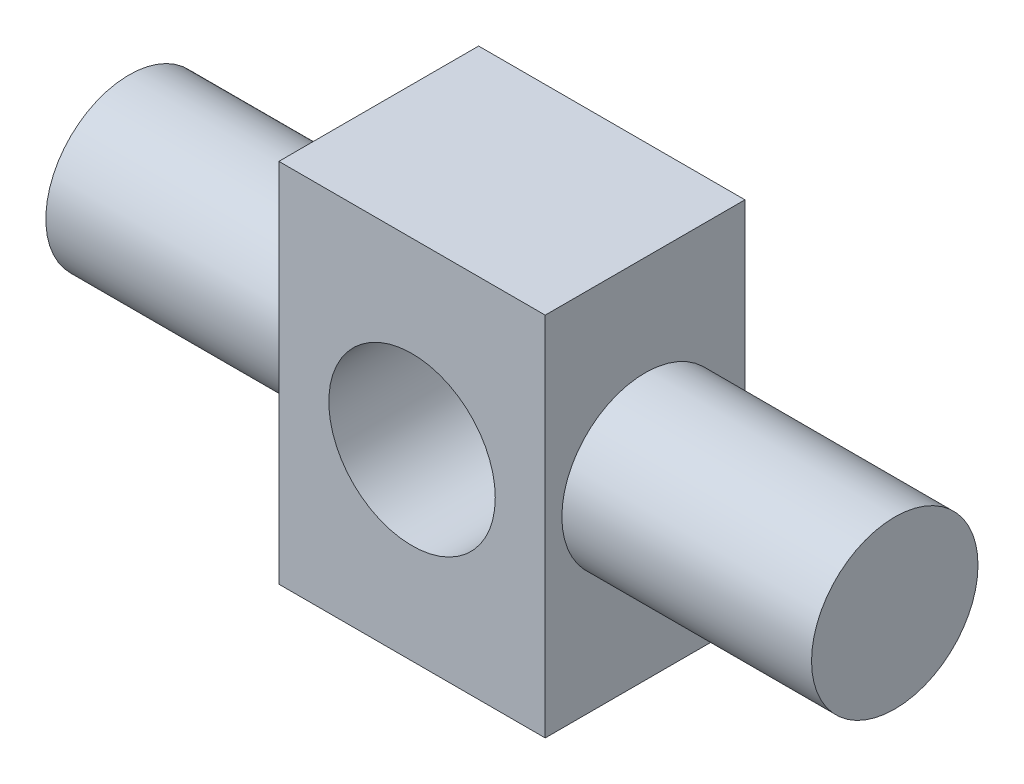
ISO-10303-21;
HEADER;
FILE_DESCRIPTION(('STEP AP214'),'2;1');
FILE_NAME('part.step','',(''),(''),'','','');
FILE_SCHEMA(('AUTOMOTIVE_DESIGN { 1 0 10303 214 1 1 1 1 }'));
ENDSEC;
DATA;
#1=APPLICATION_CONTEXT('core data for automotive mechanical design processes');
#2=APPLICATION_PROTOCOL_DEFINITION('international standard','automotive_design',2000,#1);
#3=PRODUCT_CONTEXT('',#1,'mechanical');
#4=PRODUCT('Part','Part','',(#3));
#5=PRODUCT_RELATED_PRODUCT_CATEGORY('part','',(#4));
#6=PRODUCT_DEFINITION_FORMATION('','',#4);
#7=PRODUCT_DEFINITION_CONTEXT('part definition',#1,'design');
#8=PRODUCT_DEFINITION('design','',#6,#7);
#9=PRODUCT_DEFINITION_SHAPE('','',#8);
#10=(LENGTH_UNIT() NAMED_UNIT(*) SI_UNIT(.MILLI.,.METRE.));
#11=(NAMED_UNIT(*) PLANE_ANGLE_UNIT() SI_UNIT($,.RADIAN.));
#12=(NAMED_UNIT(*) SI_UNIT($,.STERADIAN.) SOLID_ANGLE_UNIT());
#13=UNCERTAINTY_MEASURE_WITH_UNIT(LENGTH_MEASURE(1.E-05),#10,'distance_accuracy_value','');
#14=(GEOMETRIC_REPRESENTATION_CONTEXT(3) GLOBAL_UNCERTAINTY_ASSIGNED_CONTEXT((#13)) GLOBAL_UNIT_ASSIGNED_CONTEXT((#10,
#11,#12)) REPRESENTATION_CONTEXT('',''));
#15=CARTESIAN_POINT('',(0.,0.,0.));
#16=DIRECTION('',(0.,0.,1.));
#17=DIRECTION('',(1.,0.,0.));
#18=AXIS2_PLACEMENT_3D('',#15,#16,#17);
#19=CARTESIAN_POINT('',(8.,-11.,6.));
#20=DIRECTION('',(-1.,0.,0.));
#21=DIRECTION('',(0.,0.,1.));
#22=AXIS2_PLACEMENT_3D('',#19,#20,#21);
#23=PLANE('',#22);
#24=CARTESIAN_POINT('',(8.,0.,0.));
#25=DIRECTION('',(-1.,0.,0.));
#26=DIRECTION('',(0.,0.,1.));
#27=AXIS2_PLACEMENT_3D('',#24,#25,#26);
#28=CIRCLE('',#27,5.);
#29=CARTESIAN_POINT('',(8.,0.,5.));
#30=VERTEX_POINT('',#29);
#31=EDGE_CURVE('E11',#30,#30,#28,.F.);
#32=ORIENTED_EDGE('',*,*,#31,.F.);
#33=EDGE_LOOP('',(#32));
#34=FACE_BOUND('',#33,.T.);
#35=DIRECTION('',(0.,1.,0.));
#36=VECTOR('',#35,1.);
#37=CARTESIAN_POINT('',(8.,-11.,-6.));
#38=LINE('',#37,#36);
#39=CARTESIAN_POINT('',(8.,-11.,-6.));
#40=VERTEX_POINT('',#39);
#41=CARTESIAN_POINT('',(8.,11.,-6.));
#42=VERTEX_POINT('',#41);
#43=EDGE_CURVE('E101',#40,#42,#38,.T.);
#44=ORIENTED_EDGE('',*,*,#43,.T.);
#45=DIRECTION('',(0.,0.,-1.));
#46=VECTOR('',#45,1.);
#47=CARTESIAN_POINT('',(8.,11.,6.));
#48=LINE('',#47,#46);
#49=CARTESIAN_POINT('',(8.,11.,6.));
#50=VERTEX_POINT('',#49);
#51=EDGE_CURVE('E43',#50,#42,#48,.T.);
#52=ORIENTED_EDGE('',*,*,#51,.F.);
#53=DIRECTION('',(0.,1.,0.));
#54=VECTOR('',#53,1.);
#55=CARTESIAN_POINT('',(8.,-11.,6.));
#56=LINE('',#55,#54);
#57=CARTESIAN_POINT('',(8.,-11.,6.));
#58=VERTEX_POINT('',#57);
#59=EDGE_CURVE('E87',#58,#50,#56,.T.);
#60=ORIENTED_EDGE('',*,*,#59,.F.);
#61=DIRECTION('',(0.,0.,-1.));
#62=VECTOR('',#61,1.);
#63=CARTESIAN_POINT('',(8.,-11.,6.));
#64=LINE('',#63,#62);
#65=EDGE_CURVE('E97',#58,#40,#64,.T.);
#66=ORIENTED_EDGE('',*,*,#65,.T.);
#67=EDGE_LOOP('',(#44,#52,#60,#66));
#68=FACE_BOUND('',#67,.T.);
#69=ADVANCED_FACE('F35',(#34,#68),#23,.F.);
#70=CARTESIAN_POINT('',(-8.,11.,6.));
#71=DIRECTION('',(0.,-1.,0.));
#72=DIRECTION('',(0.,0.,-1.));
#73=AXIS2_PLACEMENT_3D('',#70,#71,#72);
#74=PLANE('',#73);
#75=DIRECTION('',(-1.,0.,0.));
#76=VECTOR('',#75,1.);
#77=CARTESIAN_POINT('',(-8.,11.,-6.));
#78=LINE('',#77,#76);
#79=CARTESIAN_POINT('',(-8.,11.,-6.));
#80=VERTEX_POINT('',#79);
#81=EDGE_CURVE('E92',#42,#80,#78,.T.);
#82=ORIENTED_EDGE('',*,*,#81,.T.);
#83=DIRECTION('',(0.,0.,-1.));
#84=VECTOR('',#83,1.);
#85=CARTESIAN_POINT('',(-8.,11.,6.));
#86=LINE('',#85,#84);
#87=CARTESIAN_POINT('',(-8.,11.,6.));
#88=VERTEX_POINT('',#87);
#89=EDGE_CURVE('E90',#88,#80,#86,.T.);
#90=ORIENTED_EDGE('',*,*,#89,.F.);
#91=DIRECTION('',(-1.,0.,0.));
#92=VECTOR('',#91,1.);
#93=CARTESIAN_POINT('',(-8.,11.,6.));
#94=LINE('',#93,#92);
#95=EDGE_CURVE('E82',#50,#88,#94,.T.);
#96=ORIENTED_EDGE('',*,*,#95,.F.);
#97=ORIENTED_EDGE('',*,*,#51,.T.);
#98=EDGE_LOOP('',(#82,#90,#96,#97));
#99=FACE_BOUND('',#98,.T.);
#100=ADVANCED_FACE('F91',(#99),#74,.F.);
#101=CARTESIAN_POINT('',(-8.,-11.,6.));
#102=DIRECTION('',(1.,0.,0.));
#103=DIRECTION('',(0.,0.,-1.));
#104=AXIS2_PLACEMENT_3D('',#101,#102,#103);
#105=PLANE('',#104);
#106=CARTESIAN_POINT('',(-8.,0.,0.));
#107=DIRECTION('',(1.,0.,0.));
#108=DIRECTION('',(0.,0.,-1.));
#109=AXIS2_PLACEMENT_3D('',#106,#107,#108);
#110=CIRCLE('',#109,5.);
#111=CARTESIAN_POINT('',(-8.,0.,-5.));
#112=VERTEX_POINT('',#111);
#113=EDGE_CURVE('E222',#112,#112,#110,.T.);
#114=ORIENTED_EDGE('',*,*,#113,.T.);
#115=EDGE_LOOP('',(#114));
#116=FACE_BOUND('',#115,.T.);
#117=DIRECTION('',(0.,-1.,0.));
#118=VECTOR('',#117,1.);
#119=CARTESIAN_POINT('',(-8.,-11.,-6.));
#120=LINE('',#119,#118);
#121=CARTESIAN_POINT('',(-8.,-11.,-6.));
#122=VERTEX_POINT('',#121);
#123=EDGE_CURVE('E68',#80,#122,#120,.T.);
#124=ORIENTED_EDGE('',*,*,#123,.T.);
#125=DIRECTION('',(0.,0.,-1.));
#126=VECTOR('',#125,1.);
#127=CARTESIAN_POINT('',(-8.,-11.,6.));
#128=LINE('',#127,#126);
#129=CARTESIAN_POINT('',(-8.,-11.,6.));
#130=VERTEX_POINT('',#129);
#131=EDGE_CURVE('E93',#130,#122,#128,.T.);
#132=ORIENTED_EDGE('',*,*,#131,.F.);
#133=DIRECTION('',(0.,-1.,0.));
#134=VECTOR('',#133,1.);
#135=CARTESIAN_POINT('',(-8.,-11.,6.));
#136=LINE('',#135,#134);
#137=EDGE_CURVE('E85',#88,#130,#136,.T.);
#138=ORIENTED_EDGE('',*,*,#137,.F.);
#139=ORIENTED_EDGE('',*,*,#89,.T.);
#140=EDGE_LOOP('',(#124,#132,#138,#139));
#141=FACE_BOUND('',#140,.T.);
#142=ADVANCED_FACE('F95',(#116,#141),#105,.F.);
#143=CARTESIAN_POINT('',(-8.,-11.,6.));
#144=DIRECTION('',(0.,1.,0.));
#145=DIRECTION('',(0.,0.,1.));
#146=AXIS2_PLACEMENT_3D('',#143,#144,#145);
#147=PLANE('',#146);
#148=DIRECTION('',(1.,0.,0.));
#149=VECTOR('',#148,1.);
#150=CARTESIAN_POINT('',(-8.,-11.,-6.));
#151=LINE('',#150,#149);
#152=EDGE_CURVE('E74',#122,#40,#151,.T.);
#153=ORIENTED_EDGE('',*,*,#152,.T.);
#154=ORIENTED_EDGE('',*,*,#65,.F.);
#155=DIRECTION('',(1.,0.,0.));
#156=VECTOR('',#155,1.);
#157=CARTESIAN_POINT('',(-8.,-11.,6.));
#158=LINE('',#157,#156);
#159=EDGE_CURVE('E51',#130,#58,#158,.T.);
#160=ORIENTED_EDGE('',*,*,#159,.F.);
#161=ORIENTED_EDGE('',*,*,#131,.T.);
#162=EDGE_LOOP('',(#153,#154,#160,#161));
#163=FACE_BOUND('',#162,.T.);
#164=ADVANCED_FACE('F124',(#163),#147,.F.);
#165=CARTESIAN_POINT('',(0.,0.,6.));
#166=DIRECTION('',(0.,0.,-1.));
#167=DIRECTION('',(-1.,0.,0.));
#168=AXIS2_PLACEMENT_3D('',#165,#166,#167);
#169=PLANE('',#168);
#170=CARTESIAN_POINT('',(0.,0.,6.));
#171=DIRECTION('',(0.,0.,1.));
#172=DIRECTION('',(1.,0.,0.));
#173=AXIS2_PLACEMENT_3D('',#170,#171,#172);
#174=CIRCLE('',#173,5.);
#175=CARTESIAN_POINT('',(5.,0.,6.));
#176=VERTEX_POINT('',#175);
#177=EDGE_CURVE('E228',#176,#176,#174,.T.);
#178=ORIENTED_EDGE('',*,*,#177,.F.);
#179=EDGE_LOOP('',(#178));
#180=FACE_BOUND('',#179,.T.);
#181=ORIENTED_EDGE('',*,*,#59,.T.);
#182=ORIENTED_EDGE('',*,*,#95,.T.);
#183=ORIENTED_EDGE('',*,*,#137,.T.);
#184=ORIENTED_EDGE('',*,*,#159,.T.);
#185=EDGE_LOOP('',(#181,#182,#183,#184));
#186=FACE_BOUND('',#185,.T.);
#187=ADVANCED_FACE('F83',(#180,#186),#169,.F.);
#188=CARTESIAN_POINT('',(0.,0.,-6.));
#189=DIRECTION('',(0.,0.,-1.));
#190=DIRECTION('',(-1.,0.,0.));
#191=AXIS2_PLACEMENT_3D('',#188,#189,#190);
#192=PLANE('',#191);
#193=CARTESIAN_POINT('',(0.,0.,-6.));
#194=DIRECTION('',(0.,0.,1.));
#195=DIRECTION('',(1.,0.,0.));
#196=AXIS2_PLACEMENT_3D('',#193,#194,#195);
#197=CIRCLE('',#196,5.);
#198=CARTESIAN_POINT('',(5.,0.,-6.));
#199=VERTEX_POINT('',#198);
#200=EDGE_CURVE('E226',#199,#199,#197,.T.);
#201=ORIENTED_EDGE('',*,*,#200,.T.);
#202=EDGE_LOOP('',(#201));
#203=FACE_BOUND('',#202,.T.);
#204=ORIENTED_EDGE('',*,*,#43,.F.);
#205=ORIENTED_EDGE('',*,*,#152,.F.);
#206=ORIENTED_EDGE('',*,*,#123,.F.);
#207=ORIENTED_EDGE('',*,*,#81,.F.);
#208=EDGE_LOOP('',(#204,#205,#206,#207));
#209=FACE_BOUND('',#208,.T.);
#210=ADVANCED_FACE('F112',(#203,#209),#192,.T.);
#211=CARTESIAN_POINT('',(23.,0.,0.));
#212=DIRECTION('',(-1.,0.,0.));
#213=DIRECTION('',(0.,0.,1.));
#214=AXIS2_PLACEMENT_3D('',#211,#212,#213);
#215=CYLINDRICAL_SURFACE('',#214,5.);
#216=CARTESIAN_POINT('',(23.,0.,0.));
#217=DIRECTION('',(1.,0.,0.));
#218=DIRECTION('',(0.,0.,-1.));
#219=AXIS2_PLACEMENT_3D('',#216,#217,#218);
#220=CIRCLE('',#219,5.);
#221=CARTESIAN_POINT('',(23.,0.,-5.));
#222=VERTEX_POINT('',#221);
#223=EDGE_CURVE('E104',#222,#222,#220,.T.);
#224=ORIENTED_EDGE('',*,*,#223,.F.);
#225=EDGE_LOOP('',(#224));
#226=FACE_BOUND('',#225,.T.);
#227=ORIENTED_EDGE('',*,*,#31,.T.);
#228=EDGE_LOOP('',(#227));
#229=FACE_BOUND('',#228,.T.);
#230=ADVANCED_FACE('F114',(#226,#229),#215,.T.);
#231=CARTESIAN_POINT('',(23.,0.,0.));
#232=DIRECTION('',(1.,0.,0.));
#233=DIRECTION('',(0.,0.,-1.));
#234=AXIS2_PLACEMENT_3D('',#231,#232,#233);
#235=PLANE('',#234);
#236=ORIENTED_EDGE('',*,*,#223,.T.);
#237=EDGE_LOOP('',(#236));
#238=FACE_BOUND('',#237,.T.);
#239=ADVANCED_FACE('F121',(#238),#235,.T.);
#240=CARTESIAN_POINT('',(-23.,0.,0.));
#241=DIRECTION('',(1.,0.,0.));
#242=DIRECTION('',(0.,0.,-1.));
#243=AXIS2_PLACEMENT_3D('',#240,#241,#242);
#244=CYLINDRICAL_SURFACE('',#243,5.);
#245=CARTESIAN_POINT('',(-23.,0.,0.));
#246=DIRECTION('',(1.,0.,0.));
#247=DIRECTION('',(0.,0.,-1.));
#248=AXIS2_PLACEMENT_3D('',#245,#246,#247);
#249=CIRCLE('',#248,5.);
#250=CARTESIAN_POINT('',(-23.,0.,-5.));
#251=VERTEX_POINT('',#250);
#252=EDGE_CURVE('E219',#251,#251,#249,.T.);
#253=ORIENTED_EDGE('',*,*,#252,.T.);
#254=EDGE_LOOP('',(#253));
#255=FACE_BOUND('',#254,.T.);
#256=ORIENTED_EDGE('',*,*,#113,.F.);
#257=EDGE_LOOP('',(#256));
#258=FACE_BOUND('',#257,.T.);
#259=ADVANCED_FACE('F177',(#255,#258),#244,.T.);
#260=CARTESIAN_POINT('',(-23.,0.,0.));
#261=DIRECTION('',(-1.,0.,0.));
#262=DIRECTION('',(0.,0.,-1.));
#263=AXIS2_PLACEMENT_3D('',#260,#261,#262);
#264=PLANE('',#263);
#265=ORIENTED_EDGE('',*,*,#252,.F.);
#266=EDGE_LOOP('',(#265));
#267=FACE_BOUND('',#266,.T.);
#268=ADVANCED_FACE('F156',(#267),#264,.T.);
#269=CARTESIAN_POINT('',(0.,0.,-6.));
#270=DIRECTION('',(0.,0.,1.));
#271=DIRECTION('',(1.,0.,0.));
#272=AXIS2_PLACEMENT_3D('',#269,#270,#271);
#273=CYLINDRICAL_SURFACE('',#272,5.);
#274=ORIENTED_EDGE('',*,*,#200,.F.);
#275=EDGE_LOOP('',(#274));
#276=FACE_BOUND('',#275,.T.);
#277=ORIENTED_EDGE('',*,*,#177,.T.);
#278=EDGE_LOOP('',(#277));
#279=FACE_BOUND('',#278,.T.);
#280=ADVANCED_FACE('F166',(#276,#279),#273,.F.);
#281=CLOSED_SHELL('',(#69,#100,#142,#164,#187,#210,#230,#239,#259,#268,#280));
#282=MANIFOLD_SOLID_BREP('B2',#281);
#283=ADVANCED_BREP_SHAPE_REPRESENTATION('',(#18,#282),#14);
#284=SHAPE_DEFINITION_REPRESENTATION(#9,#283);
ENDSEC;
END-ISO-10303-21;
